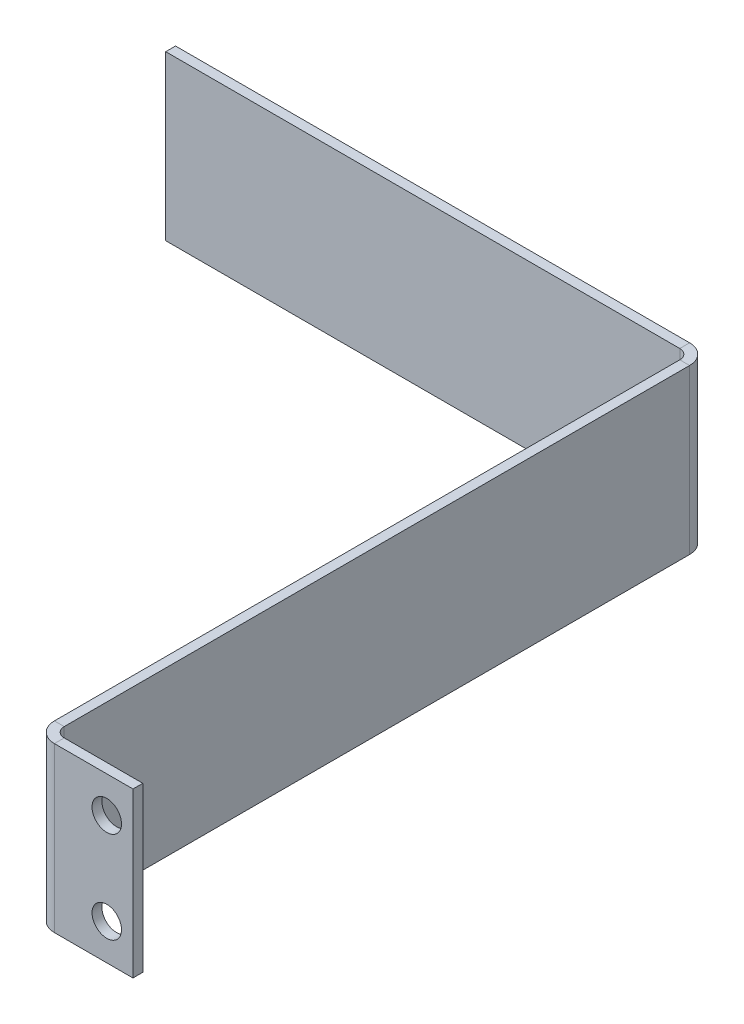
ISO-10303-21;
HEADER;
FILE_DESCRIPTION(('STEP AP214'),'2;1');
FILE_NAME('part.step','',(''),(''),'','','');
FILE_SCHEMA(('AUTOMOTIVE_DESIGN { 1 0 10303 214 1 1 1 1 }'));
ENDSEC;
DATA;
#1=APPLICATION_CONTEXT('core data for automotive mechanical design processes');
#2=APPLICATION_PROTOCOL_DEFINITION('international standard','automotive_design',2000,#1);
#3=PRODUCT_CONTEXT('',#1,'mechanical');
#4=PRODUCT('Part','Part','',(#3));
#5=PRODUCT_RELATED_PRODUCT_CATEGORY('part','',(#4));
#6=PRODUCT_DEFINITION_FORMATION('','',#4);
#7=PRODUCT_DEFINITION_CONTEXT('part definition',#1,'design');
#8=PRODUCT_DEFINITION('design','',#6,#7);
#9=PRODUCT_DEFINITION_SHAPE('','',#8);
#10=(LENGTH_UNIT() NAMED_UNIT(*) SI_UNIT(.MILLI.,.METRE.));
#11=(NAMED_UNIT(*) PLANE_ANGLE_UNIT() SI_UNIT($,.RADIAN.));
#12=(NAMED_UNIT(*) SI_UNIT($,.STERADIAN.) SOLID_ANGLE_UNIT());
#13=UNCERTAINTY_MEASURE_WITH_UNIT(LENGTH_MEASURE(1.E-05),#10,'distance_accuracy_value','');
#14=(GEOMETRIC_REPRESENTATION_CONTEXT(3) GLOBAL_UNCERTAINTY_ASSIGNED_CONTEXT((#13)) GLOBAL_UNIT_ASSIGNED_CONTEXT((#10,
#11,#12)) REPRESENTATION_CONTEXT('',''));
#15=CARTESIAN_POINT('',(0.,0.,0.));
#16=DIRECTION('',(0.,0.,1.));
#17=DIRECTION('',(1.,0.,0.));
#18=AXIS2_PLACEMENT_3D('',#15,#16,#17);
#19=CARTESIAN_POINT('',(-15.,12.5,-3.));
#20=DIRECTION('',(0.,1.,0.));
#21=DIRECTION('',(0.,0.,1.));
#22=AXIS2_PLACEMENT_3D('',#19,#20,#21);
#23=PLANE('',#22);
#24=DIRECTION('',(1.,0.,0.));
#25=VECTOR('',#24,1.);
#26=CARTESIAN_POINT('',(-15.,12.5,-3.));
#27=LINE('',#26,#25);
#28=CARTESIAN_POINT('',(-15.,12.5,-3.));
#29=VERTEX_POINT('',#28);
#30=CARTESIAN_POINT('',(-13.5,12.5,-3.));
#31=VERTEX_POINT('',#30);
#32=EDGE_CURVE('E11',#29,#31,#27,.T.);
#33=ORIENTED_EDGE('',*,*,#32,.F.);
#34=CARTESIAN_POINT('',(-12.,12.5,-3.));
#35=DIRECTION('',(0.,1.,0.));
#36=DIRECTION('',(0.,0.,1.));
#37=AXIS2_PLACEMENT_3D('',#34,#35,#36);
#38=CIRCLE('',#37,3.);
#39=CARTESIAN_POINT('',(-12.,12.5,0.));
#40=VERTEX_POINT('',#39);
#41=EDGE_CURVE('E248',#40,#29,#38,.F.);
#42=ORIENTED_EDGE('',*,*,#41,.F.);
#43=DIRECTION('',(0.,0.,1.));
#44=VECTOR('',#43,1.);
#45=CARTESIAN_POINT('',(-12.,12.5,-1.5));
#46=LINE('',#45,#44);
#47=CARTESIAN_POINT('',(-12.,12.5,-1.5));
#48=VERTEX_POINT('',#47);
#49=EDGE_CURVE('E45',#48,#40,#46,.T.);
#50=ORIENTED_EDGE('',*,*,#49,.F.);
#51=CARTESIAN_POINT('',(-12.,12.5,-3.));
#52=DIRECTION('',(0.,1.,0.));
#53=DIRECTION('',(1.,0.,0.));
#54=AXIS2_PLACEMENT_3D('',#51,#52,#53);
#55=CIRCLE('',#54,1.5);
#56=EDGE_CURVE('E146',#48,#31,#55,.F.);
#57=ORIENTED_EDGE('',*,*,#56,.T.);
#58=EDGE_LOOP('',(#33,#42,#50,#57));
#59=FACE_BOUND('',#58,.T.);
#60=ADVANCED_FACE('F37',(#59),#23,.T.);
#61=CARTESIAN_POINT('',(-12.,12.5,-1.5));
#62=DIRECTION('',(0.,1.,0.));
#63=DIRECTION('',(0.,0.,1.));
#64=AXIS2_PLACEMENT_3D('',#61,#62,#63);
#65=PLANE('',#64);
#66=DIRECTION('',(0.,0.,-1.));
#67=VECTOR('',#66,1.);
#68=CARTESIAN_POINT('',(-15.,12.5,0.));
#69=LINE('',#68,#67);
#70=CARTESIAN_POINT('',(-15.,12.5,-98.5));
#71=VERTEX_POINT('',#70);
#72=EDGE_CURVE('E140',#29,#71,#69,.T.);
#73=ORIENTED_EDGE('',*,*,#72,.F.);
#74=ORIENTED_EDGE('',*,*,#32,.T.);
#75=DIRECTION('',(0.,0.,-1.));
#76=VECTOR('',#75,1.);
#77=CARTESIAN_POINT('',(-13.5,12.5,0.));
#78=LINE('',#77,#76);
#79=CARTESIAN_POINT('',(-13.5,12.5,-98.5));
#80=VERTEX_POINT('',#79);
#81=EDGE_CURVE('E137',#31,#80,#78,.T.);
#82=ORIENTED_EDGE('',*,*,#81,.T.);
#83=DIRECTION('',(-1.,0.,0.));
#84=VECTOR('',#83,1.);
#85=CARTESIAN_POINT('',(-13.5,12.5,-98.5));
#86=LINE('',#85,#84);
#87=EDGE_CURVE('E229',#80,#71,#86,.T.);
#88=ORIENTED_EDGE('',*,*,#87,.T.);
#89=EDGE_LOOP('',(#73,#74,#82,#88));
#90=FACE_BOUND('',#89,.T.);
#91=ADVANCED_FACE('F135',(#90),#65,.T.);
#92=CARTESIAN_POINT('',(-12.,-12.5,0.));
#93=DIRECTION('',(0.,-1.,0.));
#94=DIRECTION('',(0.,0.,-1.));
#95=AXIS2_PLACEMENT_3D('',#92,#93,#94);
#96=PLANE('',#95);
#97=DIRECTION('',(0.,0.,-1.));
#98=VECTOR('',#97,1.);
#99=CARTESIAN_POINT('',(-12.,-12.5,0.));
#100=LINE('',#99,#98);
#101=CARTESIAN_POINT('',(-12.,-12.5,0.));
#102=VERTEX_POINT('',#101);
#103=CARTESIAN_POINT('',(-12.,-12.5,-1.5));
#104=VERTEX_POINT('',#103);
#105=EDGE_CURVE('E234',#102,#104,#100,.T.);
#106=ORIENTED_EDGE('',*,*,#105,.F.);
#107=CARTESIAN_POINT('',(-12.,-12.5,-3.));
#108=DIRECTION('',(0.,1.,0.));
#109=DIRECTION('',(0.,0.,1.));
#110=AXIS2_PLACEMENT_3D('',#107,#108,#109);
#111=CIRCLE('',#110,3.);
#112=CARTESIAN_POINT('',(-15.,-12.5,-3.));
#113=VERTEX_POINT('',#112);
#114=EDGE_CURVE('E186',#102,#113,#111,.F.);
#115=ORIENTED_EDGE('',*,*,#114,.T.);
#116=DIRECTION('',(-1.,0.,0.));
#117=VECTOR('',#116,1.);
#118=CARTESIAN_POINT('',(-13.5,-12.5,-3.));
#119=LINE('',#118,#117);
#120=CARTESIAN_POINT('',(-13.5,-12.5,-3.));
#121=VERTEX_POINT('',#120);
#122=EDGE_CURVE('E232',#121,#113,#119,.T.);
#123=ORIENTED_EDGE('',*,*,#122,.F.);
#124=CARTESIAN_POINT('',(-12.,-12.5,-3.));
#125=DIRECTION('',(0.,1.,0.));
#126=DIRECTION('',(1.,0.,0.));
#127=AXIS2_PLACEMENT_3D('',#124,#125,#126);
#128=CIRCLE('',#127,1.5);
#129=EDGE_CURVE('E158',#104,#121,#128,.F.);
#130=ORIENTED_EDGE('',*,*,#129,.F.);
#131=EDGE_LOOP('',(#106,#115,#123,#130));
#132=FACE_BOUND('',#131,.T.);
#133=ADVANCED_FACE('F305',(#132),#96,.T.);
#134=CARTESIAN_POINT('',(-13.5,-12.5,-3.));
#135=DIRECTION('',(0.,-1.,0.));
#136=DIRECTION('',(0.,0.,-1.));
#137=AXIS2_PLACEMENT_3D('',#134,#135,#136);
#138=PLANE('',#137);
#139=DIRECTION('',(-1.,0.,0.));
#140=VECTOR('',#139,1.);
#141=CARTESIAN_POINT('',(0.,-12.5,0.));
#142=LINE('',#141,#140);
#143=CARTESIAN_POINT('',(0.,-12.5,0.));
#144=VERTEX_POINT('',#143);
#145=EDGE_CURVE('E189',#144,#102,#142,.T.);
#146=ORIENTED_EDGE('',*,*,#145,.T.);
#147=ORIENTED_EDGE('',*,*,#105,.T.);
#148=DIRECTION('',(-1.,0.,0.));
#149=VECTOR('',#148,1.);
#150=CARTESIAN_POINT('',(0.,-12.5,-1.5));
#151=LINE('',#150,#149);
#152=CARTESIAN_POINT('',(0.,-12.5,-1.5));
#153=VERTEX_POINT('',#152);
#154=EDGE_CURVE('E195',#153,#104,#151,.T.);
#155=ORIENTED_EDGE('',*,*,#154,.F.);
#156=DIRECTION('',(0.,0.,1.));
#157=VECTOR('',#156,1.);
#158=CARTESIAN_POINT('',(0.,-12.5,-1.5));
#159=LINE('',#158,#157);
#160=EDGE_CURVE('E192',#153,#144,#159,.T.);
#161=ORIENTED_EDGE('',*,*,#160,.T.);
#162=EDGE_LOOP('',(#146,#147,#155,#161));
#163=FACE_BOUND('',#162,.T.);
#164=ADVANCED_FACE('F346',(#163),#138,.T.);
#165=CARTESIAN_POINT('',(-16.5,12.5,-100.));
#166=DIRECTION('',(0.,1.,0.));
#167=DIRECTION('',(0.,0.,1.));
#168=AXIS2_PLACEMENT_3D('',#165,#166,#167);
#169=PLANE('',#168);
#170=DIRECTION('',(0.,0.,-1.));
#171=VECTOR('',#170,1.);
#172=CARTESIAN_POINT('',(-16.5,12.5,-100.));
#173=LINE('',#172,#171);
#174=CARTESIAN_POINT('',(-16.5,12.5,-100.));
#175=VERTEX_POINT('',#174);
#176=CARTESIAN_POINT('',(-16.5,12.5,-101.5));
#177=VERTEX_POINT('',#176);
#178=EDGE_CURVE('E53',#175,#177,#173,.T.);
#179=ORIENTED_EDGE('',*,*,#178,.F.);
#180=CARTESIAN_POINT('',(-16.5,12.5,-98.5));
#181=DIRECTION('',(0.,-1.,0.));
#182=DIRECTION('',(0.,0.,-1.));
#183=AXIS2_PLACEMENT_3D('',#180,#181,#182);
#184=CIRCLE('',#183,1.5);
#185=EDGE_CURVE('E258',#71,#175,#184,.F.);
#186=ORIENTED_EDGE('',*,*,#185,.F.);
#187=ORIENTED_EDGE('',*,*,#87,.F.);
#188=CARTESIAN_POINT('',(-16.5,12.5,-98.5));
#189=DIRECTION('',(0.,1.,0.));
#190=DIRECTION('',(1.,0.,0.));
#191=AXIS2_PLACEMENT_3D('',#188,#189,#190);
#192=CIRCLE('',#191,3.);
#193=EDGE_CURVE('E166',#80,#177,#192,.T.);
#194=ORIENTED_EDGE('',*,*,#193,.T.);
#195=EDGE_LOOP('',(#179,#186,#187,#194));
#196=FACE_BOUND('',#195,.T.);
#197=ADVANCED_FACE('F351',(#196),#169,.T.);
#198=CARTESIAN_POINT('',(-13.5,12.5,-98.5));
#199=DIRECTION('',(0.,1.,0.));
#200=DIRECTION('',(0.,0.,1.));
#201=AXIS2_PLACEMENT_3D('',#198,#199,#200);
#202=PLANE('',#201);
#203=DIRECTION('',(-1.,0.,0.));
#204=VECTOR('',#203,1.);
#205=CARTESIAN_POINT('',(-15.,12.5,-100.));
#206=LINE('',#205,#204);
#207=CARTESIAN_POINT('',(-95.,12.5,-100.));
#208=VERTEX_POINT('',#207);
#209=EDGE_CURVE('E261',#175,#208,#206,.T.);
#210=ORIENTED_EDGE('',*,*,#209,.F.);
#211=ORIENTED_EDGE('',*,*,#178,.T.);
#212=DIRECTION('',(-1.,0.,0.));
#213=VECTOR('',#212,1.);
#214=CARTESIAN_POINT('',(-15.,12.5,-101.5));
#215=LINE('',#214,#213);
#216=CARTESIAN_POINT('',(-95.,12.5,-101.5));
#217=VERTEX_POINT('',#216);
#218=EDGE_CURVE('E107',#177,#217,#215,.T.);
#219=ORIENTED_EDGE('',*,*,#218,.T.);
#220=DIRECTION('',(0.,0.,-1.));
#221=VECTOR('',#220,1.);
#222=CARTESIAN_POINT('',(-95.,12.5,-100.));
#223=LINE('',#222,#221);
#224=EDGE_CURVE('E264',#208,#217,#223,.T.);
#225=ORIENTED_EDGE('',*,*,#224,.F.);
#226=EDGE_LOOP('',(#210,#211,#219,#225));
#227=FACE_BOUND('',#226,.T.);
#228=ADVANCED_FACE('F328',(#227),#202,.T.);
#229=CARTESIAN_POINT('',(-15.,-12.5,-98.5));
#230=DIRECTION('',(0.,-1.,0.));
#231=DIRECTION('',(0.,0.,-1.));
#232=AXIS2_PLACEMENT_3D('',#229,#230,#231);
#233=PLANE('',#232);
#234=DIRECTION('',(1.,0.,0.));
#235=VECTOR('',#234,1.);
#236=CARTESIAN_POINT('',(-15.,-12.5,-98.5));
#237=LINE('',#236,#235);
#238=CARTESIAN_POINT('',(-15.,-12.5,-98.5));
#239=VERTEX_POINT('',#238);
#240=CARTESIAN_POINT('',(-13.5,-12.5,-98.5));
#241=VERTEX_POINT('',#240);
#242=EDGE_CURVE('E94',#239,#241,#237,.T.);
#243=ORIENTED_EDGE('',*,*,#242,.F.);
#244=CARTESIAN_POINT('',(-16.5,-12.5,-98.5));
#245=DIRECTION('',(0.,-1.,0.));
#246=DIRECTION('',(0.,0.,-1.));
#247=AXIS2_PLACEMENT_3D('',#244,#245,#246);
#248=CIRCLE('',#247,1.5);
#249=CARTESIAN_POINT('',(-16.5,-12.5,-100.));
#250=VERTEX_POINT('',#249);
#251=EDGE_CURVE('E182',#239,#250,#248,.F.);
#252=ORIENTED_EDGE('',*,*,#251,.T.);
#253=DIRECTION('',(0.,0.,1.));
#254=VECTOR('',#253,1.);
#255=CARTESIAN_POINT('',(-16.5,-12.5,-101.5));
#256=LINE('',#255,#254);
#257=CARTESIAN_POINT('',(-16.5,-12.5,-101.5));
#258=VERTEX_POINT('',#257);
#259=EDGE_CURVE('E101',#258,#250,#256,.T.);
#260=ORIENTED_EDGE('',*,*,#259,.F.);
#261=CARTESIAN_POINT('',(-16.5,-12.5,-98.5));
#262=DIRECTION('',(0.,1.,0.));
#263=DIRECTION('',(1.,0.,0.));
#264=AXIS2_PLACEMENT_3D('',#261,#262,#263);
#265=CIRCLE('',#264,3.);
#266=EDGE_CURVE('E201',#241,#258,#265,.T.);
#267=ORIENTED_EDGE('',*,*,#266,.F.);
#268=EDGE_LOOP('',(#243,#252,#260,#267));
#269=FACE_BOUND('',#268,.T.);
#270=ADVANCED_FACE('F317',(#269),#233,.T.);
#271=CARTESIAN_POINT('',(-16.5,-12.5,-101.5));
#272=DIRECTION('',(0.,-1.,0.));
#273=DIRECTION('',(0.,0.,-1.));
#274=AXIS2_PLACEMENT_3D('',#271,#272,#273);
#275=PLANE('',#274);
#276=DIRECTION('',(0.,0.,-1.));
#277=VECTOR('',#276,1.);
#278=CARTESIAN_POINT('',(-15.,-12.5,0.));
#279=LINE('',#278,#277);
#280=EDGE_CURVE('E184',#113,#239,#279,.T.);
#281=ORIENTED_EDGE('',*,*,#280,.T.);
#282=ORIENTED_EDGE('',*,*,#242,.T.);
#283=DIRECTION('',(0.,0.,-1.));
#284=VECTOR('',#283,1.);
#285=CARTESIAN_POINT('',(-13.5,-12.5,0.));
#286=LINE('',#285,#284);
#287=EDGE_CURVE('E199',#121,#241,#286,.T.);
#288=ORIENTED_EDGE('',*,*,#287,.F.);
#289=ORIENTED_EDGE('',*,*,#122,.T.);
#290=EDGE_LOOP('',(#281,#282,#288,#289));
#291=FACE_BOUND('',#290,.T.);
#292=ADVANCED_FACE('F306',(#291),#275,.T.);
#293=CARTESIAN_POINT('',(-15.,12.5,-101.5));
#294=DIRECTION('',(0.,0.,1.));
#295=DIRECTION('',(1.,0.,0.));
#296=AXIS2_PLACEMENT_3D('',#293,#294,#295);
#297=PLANE('',#296);
#298=DIRECTION('',(-1.,0.,0.));
#299=VECTOR('',#298,1.);
#300=CARTESIAN_POINT('',(-15.,-12.5,-101.5));
#301=LINE('',#300,#299);
#302=CARTESIAN_POINT('',(-95.,-12.5,-101.5));
#303=VERTEX_POINT('',#302);
#304=EDGE_CURVE('E172',#258,#303,#301,.T.);
#305=ORIENTED_EDGE('',*,*,#304,.T.);
#306=DIRECTION('',(0.,-1.,0.));
#307=VECTOR('',#306,1.);
#308=CARTESIAN_POINT('',(-95.,12.5,-101.5));
#309=LINE('',#308,#307);
#310=EDGE_CURVE('E225',#217,#303,#309,.T.);
#311=ORIENTED_EDGE('',*,*,#310,.F.);
#312=ORIENTED_EDGE('',*,*,#218,.F.);
#313=DIRECTION('',(0.,-1.,0.));
#314=VECTOR('',#313,1.);
#315=CARTESIAN_POINT('',(-16.5,12.5,-101.5));
#316=LINE('',#315,#314);
#317=EDGE_CURVE('E168',#177,#258,#316,.T.);
#318=ORIENTED_EDGE('',*,*,#317,.T.);
#319=EDGE_LOOP('',(#305,#311,#312,#318));
#320=FACE_BOUND('',#319,.T.);
#321=ADVANCED_FACE('F323',(#320),#297,.F.);
#322=CARTESIAN_POINT('',(-95.,12.5,-100.));
#323=DIRECTION('',(-1.,0.,0.));
#324=DIRECTION('',(0.,0.,1.));
#325=AXIS2_PLACEMENT_3D('',#322,#323,#324);
#326=PLANE('',#325);
#327=DIRECTION('',(0.,0.,-1.));
#328=VECTOR('',#327,1.);
#329=CARTESIAN_POINT('',(-95.,-12.5,-100.));
#330=LINE('',#329,#328);
#331=CARTESIAN_POINT('',(-95.,-12.5,-100.));
#332=VERTEX_POINT('',#331);
#333=EDGE_CURVE('E175',#332,#303,#330,.T.);
#334=ORIENTED_EDGE('',*,*,#333,.F.);
#335=DIRECTION('',(0.,-1.,0.));
#336=VECTOR('',#335,1.);
#337=CARTESIAN_POINT('',(-95.,12.5,-100.));
#338=LINE('',#337,#336);
#339=EDGE_CURVE('E223',#208,#332,#338,.T.);
#340=ORIENTED_EDGE('',*,*,#339,.F.);
#341=ORIENTED_EDGE('',*,*,#224,.T.);
#342=ORIENTED_EDGE('',*,*,#310,.T.);
#343=EDGE_LOOP('',(#334,#340,#341,#342));
#344=FACE_BOUND('',#343,.T.);
#345=ADVANCED_FACE('F327',(#344),#326,.T.);
#346=CARTESIAN_POINT('',(-15.,12.5,-100.));
#347=DIRECTION('',(0.,0.,1.));
#348=DIRECTION('',(1.,0.,0.));
#349=AXIS2_PLACEMENT_3D('',#346,#347,#348);
#350=PLANE('',#349);
#351=DIRECTION('',(-1.,0.,0.));
#352=VECTOR('',#351,1.);
#353=CARTESIAN_POINT('',(-15.,-12.5,-100.));
#354=LINE('',#353,#352);
#355=EDGE_CURVE('E179',#250,#332,#354,.T.);
#356=ORIENTED_EDGE('',*,*,#355,.F.);
#357=DIRECTION('',(0.,-1.,0.));
#358=VECTOR('',#357,1.);
#359=CARTESIAN_POINT('',(-16.5,12.5,-100.));
#360=LINE('',#359,#358);
#361=EDGE_CURVE('E220',#175,#250,#360,.T.);
#362=ORIENTED_EDGE('',*,*,#361,.F.);
#363=ORIENTED_EDGE('',*,*,#209,.T.);
#364=ORIENTED_EDGE('',*,*,#339,.T.);
#365=EDGE_LOOP('',(#356,#362,#363,#364));
#366=FACE_BOUND('',#365,.T.);
#367=ADVANCED_FACE('F330',(#366),#350,.T.);
#368=CARTESIAN_POINT('',(-16.5,12.5,-98.5));
#369=DIRECTION('',(0.,-1.,0.));
#370=DIRECTION('',(0.,0.,-1.));
#371=AXIS2_PLACEMENT_3D('',#368,#369,#370);
#372=CYLINDRICAL_SURFACE('',#371,1.5);
#373=ORIENTED_EDGE('',*,*,#251,.F.);
#374=DIRECTION('',(0.,-1.,0.));
#375=VECTOR('',#374,1.);
#376=CARTESIAN_POINT('',(-15.,12.5,-98.5));
#377=LINE('',#376,#375);
#378=EDGE_CURVE('E217',#71,#239,#377,.T.);
#379=ORIENTED_EDGE('',*,*,#378,.F.);
#380=ORIENTED_EDGE('',*,*,#185,.T.);
#381=ORIENTED_EDGE('',*,*,#361,.T.);
#382=EDGE_LOOP('',(#373,#379,#380,#381));
#383=FACE_BOUND('',#382,.T.);
#384=ADVANCED_FACE('F314',(#383),#372,.F.);
#385=CARTESIAN_POINT('',(-15.,12.5,0.));
#386=DIRECTION('',(-1.,0.,0.));
#387=DIRECTION('',(0.,0.,1.));
#388=AXIS2_PLACEMENT_3D('',#385,#386,#387);
#389=PLANE('',#388);
#390=ORIENTED_EDGE('',*,*,#280,.F.);
#391=DIRECTION('',(0.,-1.,0.));
#392=VECTOR('',#391,1.);
#393=CARTESIAN_POINT('',(-15.,12.5,-3.));
#394=LINE('',#393,#392);
#395=EDGE_CURVE('E214',#29,#113,#394,.T.);
#396=ORIENTED_EDGE('',*,*,#395,.F.);
#397=ORIENTED_EDGE('',*,*,#72,.T.);
#398=ORIENTED_EDGE('',*,*,#378,.T.);
#399=EDGE_LOOP('',(#390,#396,#397,#398));
#400=FACE_BOUND('',#399,.T.);
#401=ADVANCED_FACE('F309',(#400),#389,.T.);
#402=CARTESIAN_POINT('',(-12.,12.5,-3.));
#403=DIRECTION('',(0.,-1.,0.));
#404=DIRECTION('',(0.,0.,-1.));
#405=AXIS2_PLACEMENT_3D('',#402,#403,#404);
#406=CYLINDRICAL_SURFACE('',#405,3.);
#407=ORIENTED_EDGE('',*,*,#114,.F.);
#408=DIRECTION('',(0.,-1.,0.));
#409=VECTOR('',#408,1.);
#410=CARTESIAN_POINT('',(-12.,12.5,0.));
#411=LINE('',#410,#409);
#412=EDGE_CURVE('E211',#40,#102,#411,.T.);
#413=ORIENTED_EDGE('',*,*,#412,.F.);
#414=ORIENTED_EDGE('',*,*,#41,.T.);
#415=ORIENTED_EDGE('',*,*,#395,.T.);
#416=EDGE_LOOP('',(#407,#413,#414,#415));
#417=FACE_BOUND('',#416,.T.);
#418=ADVANCED_FACE('F247',(#417),#406,.T.);
#419=CARTESIAN_POINT('',(0.,12.5,0.));
#420=DIRECTION('',(0.,0.,1.));
#421=DIRECTION('',(1.,0.,0.));
#422=AXIS2_PLACEMENT_3D('',#419,#420,#421);
#423=PLANE('',#422);
#424=CARTESIAN_POINT('',(-4.,7.,0.));
#425=DIRECTION('',(0.,0.,1.));
#426=DIRECTION('',(1.,0.,0.));
#427=AXIS2_PLACEMENT_3D('',#424,#425,#426);
#428=CIRCLE('',#427,2.24999999999999);
#429=CARTESIAN_POINT('',(-1.75000000000001,7.,0.));
#430=VERTEX_POINT('',#429);
#431=EDGE_CURVE('E276',#430,#430,#428,.T.);
#432=ORIENTED_EDGE('',*,*,#431,.F.);
#433=EDGE_LOOP('',(#432));
#434=FACE_BOUND('',#433,.T.);
#435=CARTESIAN_POINT('',(-4.,-7.,0.));
#436=DIRECTION('',(0.,0.,1.));
#437=DIRECTION('',(1.,0.,0.));
#438=AXIS2_PLACEMENT_3D('',#435,#436,#437);
#439=CIRCLE('',#438,2.24999999999999);
#440=CARTESIAN_POINT('',(-1.75000000000001,-7.,0.));
#441=VERTEX_POINT('',#440);
#442=EDGE_CURVE('E270',#441,#441,#439,.T.);
#443=ORIENTED_EDGE('',*,*,#442,.F.);
#444=EDGE_LOOP('',(#443));
#445=FACE_BOUND('',#444,.T.);
#446=ORIENTED_EDGE('',*,*,#145,.F.);
#447=DIRECTION('',(0.,-1.,0.));
#448=VECTOR('',#447,1.);
#449=CARTESIAN_POINT('',(0.,12.5,0.));
#450=LINE('',#449,#448);
#451=CARTESIAN_POINT('',(0.,12.5,0.));
#452=VERTEX_POINT('',#451);
#453=EDGE_CURVE('E209',#452,#144,#450,.T.);
#454=ORIENTED_EDGE('',*,*,#453,.F.);
#455=DIRECTION('',(-1.,0.,0.));
#456=VECTOR('',#455,1.);
#457=CARTESIAN_POINT('',(0.,12.5,0.));
#458=LINE('',#457,#456);
#459=EDGE_CURVE('E241',#452,#40,#458,.T.);
#460=ORIENTED_EDGE('',*,*,#459,.T.);
#461=ORIENTED_EDGE('',*,*,#412,.T.);
#462=EDGE_LOOP('',(#446,#454,#460,#461));
#463=FACE_BOUND('',#462,.T.);
#464=ADVANCED_FACE('F252',(#434,#445,#463),#423,.T.);
#465=CARTESIAN_POINT('',(0.,12.5,-1.5));
#466=DIRECTION('',(1.,0.,0.));
#467=DIRECTION('',(0.,0.,-1.));
#468=AXIS2_PLACEMENT_3D('',#465,#466,#467);
#469=PLANE('',#468);
#470=ORIENTED_EDGE('',*,*,#160,.F.);
#471=DIRECTION('',(0.,-1.,0.));
#472=VECTOR('',#471,1.);
#473=CARTESIAN_POINT('',(0.,12.5,-1.5));
#474=LINE('',#473,#472);
#475=CARTESIAN_POINT('',(0.,12.5,-1.5));
#476=VERTEX_POINT('',#475);
#477=EDGE_CURVE('E207',#476,#153,#474,.T.);
#478=ORIENTED_EDGE('',*,*,#477,.F.);
#479=DIRECTION('',(0.,0.,1.));
#480=VECTOR('',#479,1.);
#481=CARTESIAN_POINT('',(0.,12.5,-1.5));
#482=LINE('',#481,#480);
#483=EDGE_CURVE('E253',#476,#452,#482,.T.);
#484=ORIENTED_EDGE('',*,*,#483,.T.);
#485=ORIENTED_EDGE('',*,*,#453,.T.);
#486=EDGE_LOOP('',(#470,#478,#484,#485));
#487=FACE_BOUND('',#486,.T.);
#488=ADVANCED_FACE('F285',(#487),#469,.T.);
#489=CARTESIAN_POINT('',(0.,12.5,-1.5));
#490=DIRECTION('',(0.,0.,1.));
#491=DIRECTION('',(1.,0.,0.));
#492=AXIS2_PLACEMENT_3D('',#489,#490,#491);
#493=PLANE('',#492);
#494=CARTESIAN_POINT('',(-4.,7.,-1.5));
#495=DIRECTION('',(0.,0.,1.));
#496=DIRECTION('',(1.,0.,0.));
#497=AXIS2_PLACEMENT_3D('',#494,#495,#496);
#498=CIRCLE('',#497,2.24999999999998);
#499=CARTESIAN_POINT('',(-1.75000000000002,7.,-1.5));
#500=VERTEX_POINT('',#499);
#501=EDGE_CURVE('E273',#500,#500,#498,.T.);
#502=ORIENTED_EDGE('',*,*,#501,.T.);
#503=EDGE_LOOP('',(#502));
#504=FACE_BOUND('',#503,.T.);
#505=CARTESIAN_POINT('',(-4.,-7.,-1.5));
#506=DIRECTION('',(0.,0.,1.));
#507=DIRECTION('',(1.,0.,0.));
#508=AXIS2_PLACEMENT_3D('',#505,#506,#507);
#509=CIRCLE('',#508,2.24999999999998);
#510=CARTESIAN_POINT('',(-1.75000000000002,-7.,-1.5));
#511=VERTEX_POINT('',#510);
#512=EDGE_CURVE('E176',#511,#511,#509,.T.);
#513=ORIENTED_EDGE('',*,*,#512,.T.);
#514=EDGE_LOOP('',(#513));
#515=FACE_BOUND('',#514,.T.);
#516=ORIENTED_EDGE('',*,*,#154,.T.);
#517=DIRECTION('',(0.,-1.,0.));
#518=VECTOR('',#517,1.);
#519=CARTESIAN_POINT('',(-12.,12.5,-1.5));
#520=LINE('',#519,#518);
#521=EDGE_CURVE('E160',#48,#104,#520,.T.);
#522=ORIENTED_EDGE('',*,*,#521,.F.);
#523=DIRECTION('',(-1.,0.,0.));
#524=VECTOR('',#523,1.);
#525=CARTESIAN_POINT('',(0.,12.5,-1.5));
#526=LINE('',#525,#524);
#527=EDGE_CURVE('E151',#476,#48,#526,.T.);
#528=ORIENTED_EDGE('',*,*,#527,.F.);
#529=ORIENTED_EDGE('',*,*,#477,.T.);
#530=EDGE_LOOP('',(#516,#522,#528,#529));
#531=FACE_BOUND('',#530,.T.);
#532=ADVANCED_FACE('F296',(#504,#515,#531),#493,.F.);
#533=CARTESIAN_POINT('',(-12.,12.5,-3.));
#534=DIRECTION('',(0.,-1.,0.));
#535=DIRECTION('',(0.,0.,-1.));
#536=AXIS2_PLACEMENT_3D('',#533,#534,#535);
#537=CYLINDRICAL_SURFACE('',#536,1.5);
#538=ORIENTED_EDGE('',*,*,#129,.T.);
#539=DIRECTION('',(0.,-1.,0.));
#540=VECTOR('',#539,1.);
#541=CARTESIAN_POINT('',(-13.5,12.5,-3.));
#542=LINE('',#541,#540);
#543=EDGE_CURVE('E155',#31,#121,#542,.T.);
#544=ORIENTED_EDGE('',*,*,#543,.F.);
#545=ORIENTED_EDGE('',*,*,#56,.F.);
#546=ORIENTED_EDGE('',*,*,#521,.T.);
#547=EDGE_LOOP('',(#538,#544,#545,#546));
#548=FACE_BOUND('',#547,.T.);
#549=ADVANCED_FACE('F156',(#548),#537,.F.);
#550=CARTESIAN_POINT('',(-13.5,12.5,0.));
#551=DIRECTION('',(-1.,0.,0.));
#552=DIRECTION('',(0.,0.,1.));
#553=AXIS2_PLACEMENT_3D('',#550,#551,#552);
#554=PLANE('',#553);
#555=ORIENTED_EDGE('',*,*,#287,.T.);
#556=DIRECTION('',(0.,-1.,0.));
#557=VECTOR('',#556,1.);
#558=CARTESIAN_POINT('',(-13.5,12.5,-98.5));
#559=LINE('',#558,#557);
#560=EDGE_CURVE('E161',#80,#241,#559,.T.);
#561=ORIENTED_EDGE('',*,*,#560,.F.);
#562=ORIENTED_EDGE('',*,*,#81,.F.);
#563=ORIENTED_EDGE('',*,*,#543,.T.);
#564=EDGE_LOOP('',(#555,#561,#562,#563));
#565=FACE_BOUND('',#564,.T.);
#566=ADVANCED_FACE('F163',(#565),#554,.F.);
#567=CARTESIAN_POINT('',(-16.5,12.5,-98.5));
#568=DIRECTION('',(0.,-1.,0.));
#569=DIRECTION('',(0.,0.,-1.));
#570=AXIS2_PLACEMENT_3D('',#567,#568,#569);
#571=CYLINDRICAL_SURFACE('',#570,3.);
#572=ORIENTED_EDGE('',*,*,#266,.T.);
#573=ORIENTED_EDGE('',*,*,#317,.F.);
#574=ORIENTED_EDGE('',*,*,#193,.F.);
#575=ORIENTED_EDGE('',*,*,#560,.T.);
#576=EDGE_LOOP('',(#572,#573,#574,#575));
#577=FACE_BOUND('',#576,.T.);
#578=ADVANCED_FACE('F320',(#577),#571,.T.);
#579=CARTESIAN_POINT('',(-16.5,12.5,-98.5));
#580=DIRECTION('',(0.,-1.,0.));
#581=DIRECTION('',(-1.,0.,0.));
#582=AXIS2_PLACEMENT_3D('',#579,#580,#581);
#583=PLANE('',#582);
#584=ORIENTED_EDGE('',*,*,#527,.T.);
#585=ORIENTED_EDGE('',*,*,#49,.T.);
#586=ORIENTED_EDGE('',*,*,#459,.F.);
#587=ORIENTED_EDGE('',*,*,#483,.F.);
#588=EDGE_LOOP('',(#584,#585,#586,#587));
#589=FACE_BOUND('',#588,.T.);
#590=ADVANCED_FACE('F238',(#589),#583,.F.);
#591=CARTESIAN_POINT('',(-16.5,-12.5,-98.5));
#592=DIRECTION('',(0.,-1.,0.));
#593=DIRECTION('',(-1.,0.,0.));
#594=AXIS2_PLACEMENT_3D('',#591,#592,#593);
#595=PLANE('',#594);
#596=ORIENTED_EDGE('',*,*,#304,.F.);
#597=ORIENTED_EDGE('',*,*,#259,.T.);
#598=ORIENTED_EDGE('',*,*,#355,.T.);
#599=ORIENTED_EDGE('',*,*,#333,.T.);
#600=EDGE_LOOP('',(#596,#597,#598,#599));
#601=FACE_BOUND('',#600,.T.);
#602=ADVANCED_FACE('F292',(#601),#595,.T.);
#603=CARTESIAN_POINT('',(-4.,-7.,0.));
#604=DIRECTION('',(0.,0.,1.));
#605=DIRECTION('',(1.,0.,0.));
#606=AXIS2_PLACEMENT_3D('',#603,#604,#605);
#607=CYLINDRICAL_SURFACE('',#606,2.24999999999998);
#608=ORIENTED_EDGE('',*,*,#442,.T.);
#609=EDGE_LOOP('',(#608));
#610=FACE_BOUND('',#609,.T.);
#611=ORIENTED_EDGE('',*,*,#512,.F.);
#612=EDGE_LOOP('',(#611));
#613=FACE_BOUND('',#612,.T.);
#614=ADVANCED_FACE('F289',(#610,#613),#607,.F.);
#615=CARTESIAN_POINT('',(-4.,7.,0.));
#616=DIRECTION('',(0.,0.,1.));
#617=DIRECTION('',(1.,0.,0.));
#618=AXIS2_PLACEMENT_3D('',#615,#616,#617);
#619=CYLINDRICAL_SURFACE('',#618,2.24999999999998);
#620=ORIENTED_EDGE('',*,*,#431,.T.);
#621=EDGE_LOOP('',(#620));
#622=FACE_BOUND('',#621,.T.);
#623=ORIENTED_EDGE('',*,*,#501,.F.);
#624=EDGE_LOOP('',(#623));
#625=FACE_BOUND('',#624,.T.);
#626=ADVANCED_FACE('F280',(#622,#625),#619,.F.);
#627=CLOSED_SHELL('',(#60,#91,#133,#164,#197,#228,#270,#292,#321,#345,#367,#384,#401,#418,#464,
#488,#532,#549,#566,#578,#590,#602,#614,#626));
#628=MANIFOLD_SOLID_BREP('B2',#627);
#629=ADVANCED_BREP_SHAPE_REPRESENTATION('',(#18,#628),#14);
#630=SHAPE_DEFINITION_REPRESENTATION(#9,#629);
ENDSEC;
END-ISO-10303-21;
